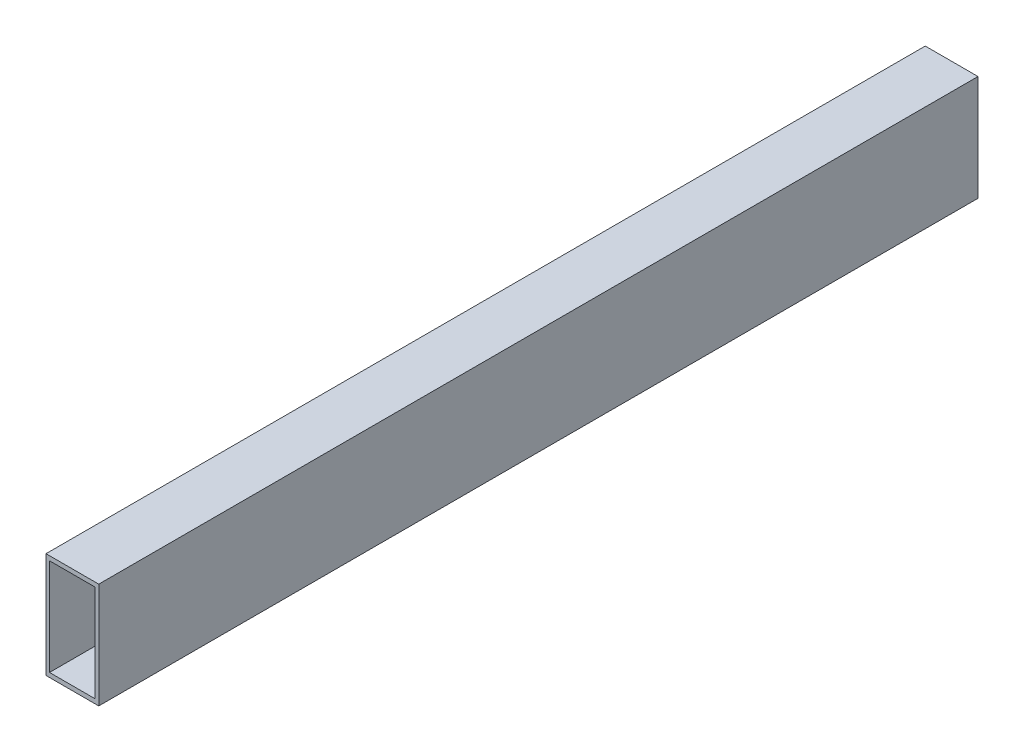
ISO-10303-21;
HEADER;
FILE_DESCRIPTION(('STEP AP214'),'2;1');
FILE_NAME('part.step','',(''),(''),'','','');
FILE_SCHEMA(('AUTOMOTIVE_DESIGN { 1 0 10303 214 1 1 1 1 }'));
ENDSEC;
DATA;
#1=APPLICATION_CONTEXT('core data for automotive mechanical design processes');
#2=APPLICATION_PROTOCOL_DEFINITION('international standard','automotive_design',2000,#1);
#3=PRODUCT_CONTEXT('',#1,'mechanical');
#4=PRODUCT('Part','Part','',(#3));
#5=PRODUCT_RELATED_PRODUCT_CATEGORY('part','',(#4));
#6=PRODUCT_DEFINITION_FORMATION('','',#4);
#7=PRODUCT_DEFINITION_CONTEXT('part definition',#1,'design');
#8=PRODUCT_DEFINITION('design','',#6,#7);
#9=PRODUCT_DEFINITION_SHAPE('','',#8);
#10=(LENGTH_UNIT() NAMED_UNIT(*) SI_UNIT(.MILLI.,.METRE.));
#11=(NAMED_UNIT(*) PLANE_ANGLE_UNIT() SI_UNIT($,.RADIAN.));
#12=(NAMED_UNIT(*) SI_UNIT($,.STERADIAN.) SOLID_ANGLE_UNIT());
#13=UNCERTAINTY_MEASURE_WITH_UNIT(LENGTH_MEASURE(1.E-05),#10,'distance_accuracy_value','');
#14=(GEOMETRIC_REPRESENTATION_CONTEXT(3) GLOBAL_UNCERTAINTY_ASSIGNED_CONTEXT((#13)) GLOBAL_UNIT_ASSIGNED_CONTEXT((#10,
#11,#12)) REPRESENTATION_CONTEXT('',''));
#15=CARTESIAN_POINT('',(0.,0.,0.));
#16=DIRECTION('',(0.,0.,1.));
#17=DIRECTION('',(1.,0.,0.));
#18=AXIS2_PLACEMENT_3D('',#15,#16,#17);
#19=CARTESIAN_POINT('',(-30.,60.,500.));
#20=DIRECTION('',(1.,0.,0.));
#21=DIRECTION('',(0.,0.,-1.));
#22=AXIS2_PLACEMENT_3D('',#19,#20,#21);
#23=PLANE('',#22);
#24=DIRECTION('',(0.,0.,-1.));
#25=VECTOR('',#24,1.);
#26=CARTESIAN_POINT('',(-30.,-60.,500.));
#27=LINE('',#26,#25);
#28=CARTESIAN_POINT('',(-30.,-60.,500.));
#29=VERTEX_POINT('',#28);
#30=CARTESIAN_POINT('',(-30.,-60.,-500.));
#31=VERTEX_POINT('',#30);
#32=EDGE_CURVE('E98',#29,#31,#27,.T.);
#33=ORIENTED_EDGE('',*,*,#32,.F.);
#34=DIRECTION('',(0.,-1.,0.));
#35=VECTOR('',#34,1.);
#36=CARTESIAN_POINT('',(-30.,60.,500.));
#37=LINE('',#36,#35);
#38=CARTESIAN_POINT('',(-30.,60.,500.));
#39=VERTEX_POINT('',#38);
#40=EDGE_CURVE('E87',#39,#29,#37,.T.);
#41=ORIENTED_EDGE('',*,*,#40,.F.);
#42=DIRECTION('',(0.,0.,-1.));
#43=VECTOR('',#42,1.);
#44=CARTESIAN_POINT('',(-30.,60.,500.));
#45=LINE('',#44,#43);
#46=CARTESIAN_POINT('',(-30.,60.,-500.));
#47=VERTEX_POINT('',#46);
#48=EDGE_CURVE('E103',#39,#47,#45,.T.);
#49=ORIENTED_EDGE('',*,*,#48,.T.);
#50=DIRECTION('',(0.,-1.,0.));
#51=VECTOR('',#50,1.);
#52=CARTESIAN_POINT('',(-30.,60.,-500.));
#53=LINE('',#52,#51);
#54=EDGE_CURVE('E99',#47,#31,#53,.T.);
#55=ORIENTED_EDGE('',*,*,#54,.T.);
#56=EDGE_LOOP('',(#33,#41,#49,#55));
#57=FACE_BOUND('',#56,.T.);
#58=ADVANCED_FACE('F35',(#57),#23,.F.);
#59=CARTESIAN_POINT('',(-30.,-60.,500.));
#60=DIRECTION('',(0.,1.,0.));
#61=DIRECTION('',(-1.,0.,0.));
#62=AXIS2_PLACEMENT_3D('',#59,#60,#61);
#63=PLANE('',#62);
#64=DIRECTION('',(0.,0.,-1.));
#65=VECTOR('',#64,1.);
#66=CARTESIAN_POINT('',(30.,-60.,500.));
#67=LINE('',#66,#65);
#68=CARTESIAN_POINT('',(30.,-60.,500.));
#69=VERTEX_POINT('',#68);
#70=CARTESIAN_POINT('',(30.,-60.,-500.));
#71=VERTEX_POINT('',#70);
#72=EDGE_CURVE('E102',#69,#71,#67,.T.);
#73=ORIENTED_EDGE('',*,*,#72,.F.);
#74=DIRECTION('',(1.,0.,0.));
#75=VECTOR('',#74,1.);
#76=CARTESIAN_POINT('',(-30.,-60.,500.));
#77=LINE('',#76,#75);
#78=EDGE_CURVE('E84',#29,#69,#77,.T.);
#79=ORIENTED_EDGE('',*,*,#78,.F.);
#80=ORIENTED_EDGE('',*,*,#32,.T.);
#81=DIRECTION('',(1.,0.,0.));
#82=VECTOR('',#81,1.);
#83=CARTESIAN_POINT('',(-30.,-60.,-500.));
#84=LINE('',#83,#82);
#85=EDGE_CURVE('E125',#31,#71,#84,.T.);
#86=ORIENTED_EDGE('',*,*,#85,.T.);
#87=EDGE_LOOP('',(#73,#79,#80,#86));
#88=FACE_BOUND('',#87,.T.);
#89=ADVANCED_FACE('F105',(#88),#63,.F.);
#90=CARTESIAN_POINT('',(30.,60.,500.));
#91=DIRECTION('',(-1.,0.,0.));
#92=DIRECTION('',(0.,-1.,0.));
#93=AXIS2_PLACEMENT_3D('',#90,#91,#92);
#94=PLANE('',#93);
#95=DIRECTION('',(0.,0.,-1.));
#96=VECTOR('',#95,1.);
#97=CARTESIAN_POINT('',(30.,60.,500.));
#98=LINE('',#97,#96);
#99=CARTESIAN_POINT('',(30.,60.,500.));
#100=VERTEX_POINT('',#99);
#101=CARTESIAN_POINT('',(30.,60.,-500.));
#102=VERTEX_POINT('',#101);
#103=EDGE_CURVE('E39',#100,#102,#98,.T.);
#104=ORIENTED_EDGE('',*,*,#103,.F.);
#105=DIRECTION('',(0.,1.,0.));
#106=VECTOR('',#105,1.);
#107=CARTESIAN_POINT('',(30.,60.,500.));
#108=LINE('',#107,#106);
#109=EDGE_CURVE('E108',#69,#100,#108,.T.);
#110=ORIENTED_EDGE('',*,*,#109,.F.);
#111=ORIENTED_EDGE('',*,*,#72,.T.);
#112=DIRECTION('',(0.,1.,0.));
#113=VECTOR('',#112,1.);
#114=CARTESIAN_POINT('',(30.,60.,-500.));
#115=LINE('',#114,#113);
#116=EDGE_CURVE('E112',#71,#102,#115,.T.);
#117=ORIENTED_EDGE('',*,*,#116,.T.);
#118=EDGE_LOOP('',(#104,#110,#111,#117));
#119=FACE_BOUND('',#118,.T.);
#120=ADVANCED_FACE('F123',(#119),#94,.F.);
#121=CARTESIAN_POINT('',(-30.,60.,500.));
#122=DIRECTION('',(0.,-1.,0.));
#123=DIRECTION('',(1.,0.,0.));
#124=AXIS2_PLACEMENT_3D('',#121,#122,#123);
#125=PLANE('',#124);
#126=DIRECTION('',(-1.,0.,0.));
#127=VECTOR('',#126,1.);
#128=CARTESIAN_POINT('',(-30.,60.,-500.));
#129=LINE('',#128,#127);
#130=EDGE_CURVE('E122',#102,#47,#129,.T.);
#131=ORIENTED_EDGE('',*,*,#130,.T.);
#132=ORIENTED_EDGE('',*,*,#48,.F.);
#133=DIRECTION('',(-1.,0.,0.));
#134=VECTOR('',#133,1.);
#135=CARTESIAN_POINT('',(-30.,60.,500.));
#136=LINE('',#135,#134);
#137=EDGE_CURVE('E91',#100,#39,#136,.T.);
#138=ORIENTED_EDGE('',*,*,#137,.F.);
#139=ORIENTED_EDGE('',*,*,#103,.T.);
#140=EDGE_LOOP('',(#131,#132,#138,#139));
#141=FACE_BOUND('',#140,.T.);
#142=ADVANCED_FACE('F37',(#141),#125,.F.);
#143=CARTESIAN_POINT('',(0.,0.,500.));
#144=DIRECTION('',(0.,0.,1.));
#145=DIRECTION('',(1.,0.,0.));
#146=AXIS2_PLACEMENT_3D('',#143,#144,#145);
#147=PLANE('',#146);
#148=DIRECTION('',(0.,-1.,0.));
#149=VECTOR('',#148,1.);
#150=CARTESIAN_POINT('',(-26.,55.,500.));
#151=LINE('',#150,#149);
#152=CARTESIAN_POINT('',(-26.,-55.,500.));
#153=VERTEX_POINT('',#152);
#154=CARTESIAN_POINT('',(-26.,55.,500.));
#155=VERTEX_POINT('',#154);
#156=EDGE_CURVE('E130',#153,#155,#151,.F.);
#157=ORIENTED_EDGE('',*,*,#156,.T.);
#158=DIRECTION('',(-1.,0.,0.));
#159=VECTOR('',#158,1.);
#160=CARTESIAN_POINT('',(-26.,55.,500.));
#161=LINE('',#160,#159);
#162=CARTESIAN_POINT('',(26.,55.,500.));
#163=VERTEX_POINT('',#162);
#164=EDGE_CURVE('E126',#155,#163,#161,.F.);
#165=ORIENTED_EDGE('',*,*,#164,.T.);
#166=DIRECTION('',(0.,1.,0.));
#167=VECTOR('',#166,1.);
#168=CARTESIAN_POINT('',(26.,55.,500.));
#169=LINE('',#168,#167);
#170=CARTESIAN_POINT('',(26.,-55.,500.));
#171=VERTEX_POINT('',#170);
#172=EDGE_CURVE('E144',#163,#171,#169,.F.);
#173=ORIENTED_EDGE('',*,*,#172,.T.);
#174=DIRECTION('',(1.,0.,0.));
#175=VECTOR('',#174,1.);
#176=CARTESIAN_POINT('',(-26.,-55.,500.));
#177=LINE('',#176,#175);
#178=EDGE_CURVE('E134',#171,#153,#177,.F.);
#179=ORIENTED_EDGE('',*,*,#178,.T.);
#180=EDGE_LOOP('',(#157,#165,#173,#179));
#181=FACE_BOUND('',#180,.T.);
#182=ORIENTED_EDGE('',*,*,#40,.T.);
#183=ORIENTED_EDGE('',*,*,#78,.T.);
#184=ORIENTED_EDGE('',*,*,#109,.T.);
#185=ORIENTED_EDGE('',*,*,#137,.T.);
#186=EDGE_LOOP('',(#182,#183,#184,#185));
#187=FACE_BOUND('',#186,.T.);
#188=ADVANCED_FACE('F89',(#181,#187),#147,.T.);
#189=CARTESIAN_POINT('',(0.,0.,-500.));
#190=DIRECTION('',(0.,0.,1.));
#191=DIRECTION('',(1.,0.,0.));
#192=AXIS2_PLACEMENT_3D('',#189,#190,#191);
#193=PLANE('',#192);
#194=DIRECTION('',(0.,-1.,0.));
#195=VECTOR('',#194,1.);
#196=CARTESIAN_POINT('',(-26.,55.,-500.));
#197=LINE('',#196,#195);
#198=CARTESIAN_POINT('',(-26.,-55.,-500.));
#199=VERTEX_POINT('',#198);
#200=CARTESIAN_POINT('',(-26.,55.,-500.));
#201=VERTEX_POINT('',#200);
#202=EDGE_CURVE('E11',#199,#201,#197,.F.);
#203=ORIENTED_EDGE('',*,*,#202,.F.);
#204=DIRECTION('',(1.,0.,0.));
#205=VECTOR('',#204,1.);
#206=CARTESIAN_POINT('',(-26.,-55.,-500.));
#207=LINE('',#206,#205);
#208=CARTESIAN_POINT('',(26.,-55.,-500.));
#209=VERTEX_POINT('',#208);
#210=EDGE_CURVE('E45',#209,#199,#207,.F.);
#211=ORIENTED_EDGE('',*,*,#210,.F.);
#212=DIRECTION('',(0.,1.,0.));
#213=VECTOR('',#212,1.);
#214=CARTESIAN_POINT('',(26.,55.,-500.));
#215=LINE('',#214,#213);
#216=CARTESIAN_POINT('',(26.,55.,-500.));
#217=VERTEX_POINT('',#216);
#218=EDGE_CURVE('E141',#217,#209,#215,.F.);
#219=ORIENTED_EDGE('',*,*,#218,.F.);
#220=DIRECTION('',(-1.,0.,0.));
#221=VECTOR('',#220,1.);
#222=CARTESIAN_POINT('',(-26.,55.,-500.));
#223=LINE('',#222,#221);
#224=EDGE_CURVE('E138',#201,#217,#223,.F.);
#225=ORIENTED_EDGE('',*,*,#224,.F.);
#226=EDGE_LOOP('',(#203,#211,#219,#225));
#227=FACE_BOUND('',#226,.T.);
#228=ORIENTED_EDGE('',*,*,#54,.F.);
#229=ORIENTED_EDGE('',*,*,#130,.F.);
#230=ORIENTED_EDGE('',*,*,#116,.F.);
#231=ORIENTED_EDGE('',*,*,#85,.F.);
#232=EDGE_LOOP('',(#228,#229,#230,#231));
#233=FACE_BOUND('',#232,.T.);
#234=ADVANCED_FACE('F191',(#227,#233),#193,.F.);
#235=CARTESIAN_POINT('',(-26.,55.,500.));
#236=DIRECTION('',(0.,1.,0.));
#237=DIRECTION('',(-1.,0.,0.));
#238=AXIS2_PLACEMENT_3D('',#235,#236,#237);
#239=PLANE('',#238);
#240=DIRECTION('',(0.,0.,-1.));
#241=VECTOR('',#240,1.);
#242=CARTESIAN_POINT('',(26.,55.,500.));
#243=LINE('',#242,#241);
#244=EDGE_CURVE('E146',#163,#217,#243,.T.);
#245=ORIENTED_EDGE('',*,*,#244,.F.);
#246=ORIENTED_EDGE('',*,*,#164,.F.);
#247=DIRECTION('',(0.,0.,-1.));
#248=VECTOR('',#247,1.);
#249=CARTESIAN_POINT('',(-26.,55.,500.));
#250=LINE('',#249,#248);
#251=EDGE_CURVE('E133',#155,#201,#250,.T.);
#252=ORIENTED_EDGE('',*,*,#251,.T.);
#253=ORIENTED_EDGE('',*,*,#224,.T.);
#254=EDGE_LOOP('',(#245,#246,#252,#253));
#255=FACE_BOUND('',#254,.T.);
#256=ADVANCED_FACE('F168',(#255),#239,.F.);
#257=CARTESIAN_POINT('',(26.,55.,500.));
#258=DIRECTION('',(1.,0.,0.));
#259=DIRECTION('',(0.,0.,-1.));
#260=AXIS2_PLACEMENT_3D('',#257,#258,#259);
#261=PLANE('',#260);
#262=DIRECTION('',(0.,0.,-1.));
#263=VECTOR('',#262,1.);
#264=CARTESIAN_POINT('',(26.,-55.,500.));
#265=LINE('',#264,#263);
#266=EDGE_CURVE('E139',#171,#209,#265,.T.);
#267=ORIENTED_EDGE('',*,*,#266,.F.);
#268=ORIENTED_EDGE('',*,*,#172,.F.);
#269=ORIENTED_EDGE('',*,*,#244,.T.);
#270=ORIENTED_EDGE('',*,*,#218,.T.);
#271=EDGE_LOOP('',(#267,#268,#269,#270));
#272=FACE_BOUND('',#271,.T.);
#273=ADVANCED_FACE('F172',(#272),#261,.F.);
#274=CARTESIAN_POINT('',(-26.,-55.,500.));
#275=DIRECTION('',(0.,-1.,0.));
#276=DIRECTION('',(1.,0.,0.));
#277=AXIS2_PLACEMENT_3D('',#274,#275,#276);
#278=PLANE('',#277);
#279=DIRECTION('',(0.,0.,-1.));
#280=VECTOR('',#279,1.);
#281=CARTESIAN_POINT('',(-26.,-55.,500.));
#282=LINE('',#281,#280);
#283=EDGE_CURVE('E135',#153,#199,#282,.T.);
#284=ORIENTED_EDGE('',*,*,#283,.F.);
#285=ORIENTED_EDGE('',*,*,#178,.F.);
#286=ORIENTED_EDGE('',*,*,#266,.T.);
#287=ORIENTED_EDGE('',*,*,#210,.T.);
#288=EDGE_LOOP('',(#284,#285,#286,#287));
#289=FACE_BOUND('',#288,.T.);
#290=ADVANCED_FACE('F180',(#289),#278,.F.);
#291=CARTESIAN_POINT('',(-26.,55.,500.));
#292=DIRECTION('',(-1.,0.,0.));
#293=DIRECTION('',(0.,0.,1.));
#294=AXIS2_PLACEMENT_3D('',#291,#292,#293);
#295=PLANE('',#294);
#296=ORIENTED_EDGE('',*,*,#202,.T.);
#297=ORIENTED_EDGE('',*,*,#251,.F.);
#298=ORIENTED_EDGE('',*,*,#156,.F.);
#299=ORIENTED_EDGE('',*,*,#283,.T.);
#300=EDGE_LOOP('',(#296,#297,#298,#299));
#301=FACE_BOUND('',#300,.T.);
#302=ADVANCED_FACE('F179',(#301),#295,.F.);
#303=CLOSED_SHELL('',(#58,#89,#120,#142,#188,#234,#256,#273,#290,#302));
#304=MANIFOLD_SOLID_BREP('B2',#303);
#305=ADVANCED_BREP_SHAPE_REPRESENTATION('',(#18,#304),#14);
#306=SHAPE_DEFINITION_REPRESENTATION(#9,#305);
ENDSEC;
END-ISO-10303-21;
